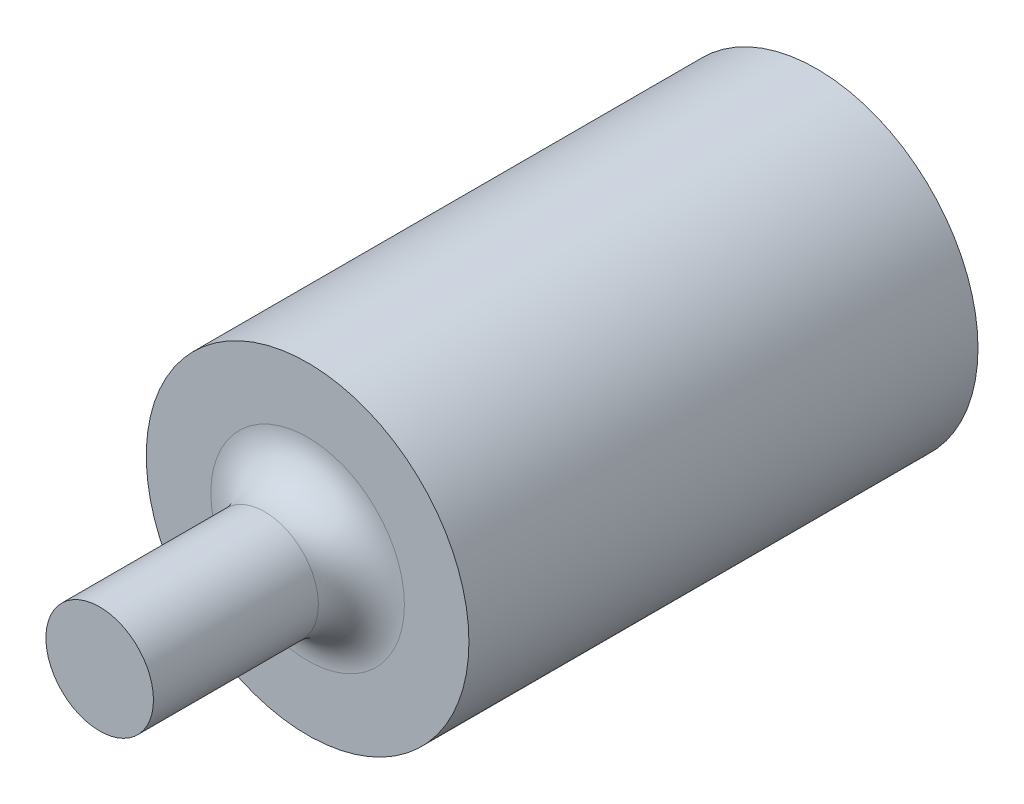
ISO-10303-21;
HEADER;
FILE_DESCRIPTION(('STEP AP214'),'2;1');
FILE_NAME('part.step','',(''),(''),'','','');
FILE_SCHEMA(('AUTOMOTIVE_DESIGN { 1 0 10303 214 1 1 1 1 }'));
ENDSEC;
DATA;
#1=APPLICATION_CONTEXT('core data for automotive mechanical design processes');
#2=APPLICATION_PROTOCOL_DEFINITION('international standard','automotive_design',2000,#1);
#3=PRODUCT_CONTEXT('',#1,'mechanical');
#4=PRODUCT('Part','Part','',(#3));
#5=PRODUCT_RELATED_PRODUCT_CATEGORY('part','',(#4));
#6=PRODUCT_DEFINITION_FORMATION('','',#4);
#7=PRODUCT_DEFINITION_CONTEXT('part definition',#1,'design');
#8=PRODUCT_DEFINITION('design','',#6,#7);
#9=PRODUCT_DEFINITION_SHAPE('','',#8);
#10=(LENGTH_UNIT() NAMED_UNIT(*) SI_UNIT(.MILLI.,.METRE.));
#11=(NAMED_UNIT(*) PLANE_ANGLE_UNIT() SI_UNIT($,.RADIAN.));
#12=(NAMED_UNIT(*) SI_UNIT($,.STERADIAN.) SOLID_ANGLE_UNIT());
#13=UNCERTAINTY_MEASURE_WITH_UNIT(LENGTH_MEASURE(1.E-05),#10,'distance_accuracy_value','');
#14=(GEOMETRIC_REPRESENTATION_CONTEXT(3) GLOBAL_UNCERTAINTY_ASSIGNED_CONTEXT((#13)) GLOBAL_UNIT_ASSIGNED_CONTEXT((#10,
#11,#12)) REPRESENTATION_CONTEXT('',''));
#15=CARTESIAN_POINT('',(0.,0.,0.));
#16=DIRECTION('',(0.,0.,1.));
#17=DIRECTION('',(1.,0.,0.));
#18=AXIS2_PLACEMENT_3D('',#15,#16,#17);
#19=CARTESIAN_POINT('',(0.,0.,35.5));
#20=DIRECTION('',(0.,0.,-1.));
#21=DIRECTION('',(-1.,0.,0.));
#22=AXIS2_PLACEMENT_3D('',#19,#20,#21);
#23=CYLINDRICAL_SURFACE('',#22,11.25);
#24=CARTESIAN_POINT('',(0.,0.,35.5));
#25=DIRECTION('',(0.,0.,1.));
#26=DIRECTION('',(1.,0.,0.));
#27=AXIS2_PLACEMENT_3D('',#24,#25,#26);
#28=CIRCLE('',#27,11.25);
#29=CARTESIAN_POINT('',(11.25,0.,35.5));
#30=VERTEX_POINT('',#29);
#31=EDGE_CURVE('E54',#30,#30,#28,.T.);
#32=ORIENTED_EDGE('',*,*,#31,.F.);
#33=EDGE_LOOP('',(#32));
#34=FACE_BOUND('',#33,.T.);
#35=CARTESIAN_POINT('',(0.,0.,0.));
#36=DIRECTION('',(0.,0.,1.));
#37=DIRECTION('',(1.,0.,0.));
#38=AXIS2_PLACEMENT_3D('',#35,#36,#37);
#39=CIRCLE('',#38,11.25);
#40=CARTESIAN_POINT('',(11.25,0.,0.));
#41=VERTEX_POINT('',#40);
#42=EDGE_CURVE('E58',#41,#41,#39,.T.);
#43=ORIENTED_EDGE('',*,*,#42,.T.);
#44=EDGE_LOOP('',(#43));
#45=FACE_BOUND('',#44,.T.);
#46=ADVANCED_FACE('F43',(#34,#45),#23,.T.);
#47=CARTESIAN_POINT('',(0.,0.,35.5));
#48=DIRECTION('',(0.,0.,1.));
#49=DIRECTION('',(1.,0.,0.));
#50=AXIS2_PLACEMENT_3D('',#47,#48,#49);
#51=PLANE('',#50);
#52=CARTESIAN_POINT('',(0.,0.,35.5));
#53=DIRECTION('',(0.,0.,1.));
#54=DIRECTION('',(1.,0.,0.));
#55=AXIS2_PLACEMENT_3D('',#52,#53,#54);
#56=CIRCLE('',#55,6.75);
#57=CARTESIAN_POINT('',(6.75,0.,35.5));
#58=VERTEX_POINT('',#57);
#59=EDGE_CURVE('E12',#58,#58,#56,.F.);
#60=ORIENTED_EDGE('',*,*,#59,.T.);
#61=EDGE_LOOP('',(#60));
#62=FACE_BOUND('',#61,.T.);
#63=ORIENTED_EDGE('',*,*,#31,.T.);
#64=EDGE_LOOP('',(#63));
#65=FACE_BOUND('',#64,.T.);
#66=ADVANCED_FACE('F104',(#62,#65),#51,.T.);
#67=CARTESIAN_POINT('',(0.,0.,0.));
#68=DIRECTION('',(0.,0.,1.));
#69=DIRECTION('',(1.,0.,0.));
#70=AXIS2_PLACEMENT_3D('',#67,#68,#69);
#71=PLANE('',#70);
#72=CARTESIAN_POINT('',(8.5,0.,0.));
#73=DIRECTION('',(0.,0.,-1.));
#74=DIRECTION('',(-1.,0.,0.));
#75=AXIS2_PLACEMENT_3D('',#72,#73,#74);
#76=CIRCLE('',#75,1.5);
#77=CARTESIAN_POINT('',(7.,0.,0.));
#78=VERTEX_POINT('',#77);
#79=EDGE_CURVE('E85',#78,#78,#76,.T.);
#80=ORIENTED_EDGE('',*,*,#79,.F.);
#81=EDGE_LOOP('',(#80));
#82=FACE_BOUND('',#81,.T.);
#83=CARTESIAN_POINT('',(-8.5,0.,0.));
#84=DIRECTION('',(0.,0.,-1.));
#85=DIRECTION('',(1.,0.,0.));
#86=AXIS2_PLACEMENT_3D('',#83,#84,#85);
#87=CIRCLE('',#86,1.5);
#88=CARTESIAN_POINT('',(-7.,0.,0.));
#89=VERTEX_POINT('',#88);
#90=EDGE_CURVE('E79',#89,#89,#87,.T.);
#91=ORIENTED_EDGE('',*,*,#90,.F.);
#92=EDGE_LOOP('',(#91));
#93=FACE_BOUND('',#92,.T.);
#94=CARTESIAN_POINT('',(0.,-8.5,0.));
#95=DIRECTION('',(0.,0.,-1.));
#96=DIRECTION('',(-1.,0.,0.));
#97=AXIS2_PLACEMENT_3D('',#94,#95,#96);
#98=CIRCLE('',#97,1.5);
#99=CARTESIAN_POINT('',(-1.50000000000009,-8.5,0.));
#100=VERTEX_POINT('',#99);
#101=EDGE_CURVE('E73',#100,#100,#98,.T.);
#102=ORIENTED_EDGE('',*,*,#101,.F.);
#103=EDGE_LOOP('',(#102));
#104=FACE_BOUND('',#103,.T.);
#105=CARTESIAN_POINT('',(0.,8.5,0.));
#106=DIRECTION('',(0.,0.,-1.));
#107=DIRECTION('',(1.,0.,0.));
#108=AXIS2_PLACEMENT_3D('',#105,#106,#107);
#109=CIRCLE('',#108,1.5);
#110=CARTESIAN_POINT('',(1.50000000000009,8.5,0.));
#111=VERTEX_POINT('',#110);
#112=EDGE_CURVE('E67',#111,#111,#109,.T.);
#113=ORIENTED_EDGE('',*,*,#112,.F.);
#114=EDGE_LOOP('',(#113));
#115=FACE_BOUND('',#114,.T.);
#116=ORIENTED_EDGE('',*,*,#42,.F.);
#117=EDGE_LOOP('',(#116));
#118=FACE_BOUND('',#117,.T.);
#119=ADVANCED_FACE('F100',(#82,#93,#104,#115,#118),#71,.F.);
#120=CARTESIAN_POINT('',(0.,0.,50.));
#121=DIRECTION('',(0.,0.,-1.));
#122=DIRECTION('',(-1.,0.,0.));
#123=AXIS2_PLACEMENT_3D('',#120,#121,#122);
#124=CYLINDRICAL_SURFACE('',#123,3.75);
#125=CARTESIAN_POINT('',(0.,0.,38.5));
#126=DIRECTION('',(0.,0.,1.));
#127=DIRECTION('',(1.,0.,0.));
#128=AXIS2_PLACEMENT_3D('',#125,#126,#127);
#129=CIRCLE('',#128,3.75);
#130=CARTESIAN_POINT('',(3.75,0.,38.5));
#131=VERTEX_POINT('',#130);
#132=EDGE_CURVE('E50',#131,#131,#129,.T.);
#133=ORIENTED_EDGE('',*,*,#132,.T.);
#134=EDGE_LOOP('',(#133));
#135=FACE_BOUND('',#134,.T.);
#136=CARTESIAN_POINT('',(0.,0.,50.));
#137=DIRECTION('',(0.,0.,1.));
#138=DIRECTION('',(1.,0.,0.));
#139=AXIS2_PLACEMENT_3D('',#136,#137,#138);
#140=CIRCLE('',#139,3.75);
#141=CARTESIAN_POINT('',(3.75,0.,50.));
#142=VERTEX_POINT('',#141);
#143=EDGE_CURVE('E62',#142,#142,#140,.T.);
#144=ORIENTED_EDGE('',*,*,#143,.F.);
#145=EDGE_LOOP('',(#144));
#146=FACE_BOUND('',#145,.T.);
#147=ADVANCED_FACE('F103',(#135,#146),#124,.T.);
#148=CARTESIAN_POINT('',(0.,0.,50.));
#149=DIRECTION('',(0.,0.,1.));
#150=DIRECTION('',(1.,0.,0.));
#151=AXIS2_PLACEMENT_3D('',#148,#149,#150);
#152=PLANE('',#151);
#153=ORIENTED_EDGE('',*,*,#143,.T.);
#154=EDGE_LOOP('',(#153));
#155=FACE_BOUND('',#154,.T.);
#156=ADVANCED_FACE('F124',(#155),#152,.T.);
#157=CARTESIAN_POINT('',(0.,0.,38.5));
#158=DIRECTION('',(0.,0.,1.));
#159=DIRECTION('',(1.,0.,0.));
#160=AXIS2_PLACEMENT_3D('',#157,#158,#159);
#161=TOROIDAL_SURFACE('',#160,6.75,3.);
#162=ORIENTED_EDGE('',*,*,#59,.F.);
#163=EDGE_LOOP('',(#162));
#164=FACE_BOUND('',#163,.T.);
#165=ORIENTED_EDGE('',*,*,#132,.F.);
#166=EDGE_LOOP('',(#165));
#167=FACE_BOUND('',#166,.T.);
#168=ADVANCED_FACE('F45',(#164,#167),#161,.F.);
#169=CARTESIAN_POINT('',(0.,8.5,10.));
#170=DIRECTION('',(0.,0.,-1.));
#171=DIRECTION('',(-1.,0.,0.));
#172=AXIS2_PLACEMENT_3D('',#169,#170,#171);
#173=CYLINDRICAL_SURFACE('',#172,1.5);
#174=CARTESIAN_POINT('',(0.,8.5,10.));
#175=DIRECTION('',(0.,0.,-1.));
#176=DIRECTION('',(1.,0.,0.));
#177=AXIS2_PLACEMENT_3D('',#174,#175,#176);
#178=CIRCLE('',#177,1.5);
#179=CARTESIAN_POINT('',(1.50000000000009,8.5,10.));
#180=VERTEX_POINT('',#179);
#181=EDGE_CURVE('E70',#180,#180,#178,.T.);
#182=ORIENTED_EDGE('',*,*,#181,.F.);
#183=EDGE_LOOP('',(#182));
#184=FACE_BOUND('',#183,.T.);
#185=ORIENTED_EDGE('',*,*,#112,.T.);
#186=EDGE_LOOP('',(#185));
#187=FACE_BOUND('',#186,.T.);
#188=ADVANCED_FACE('F128',(#184,#187),#173,.F.);
#189=CARTESIAN_POINT('',(0.,8.5,10.));
#190=DIRECTION('',(0.,0.,1.));
#191=DIRECTION('',(1.,0.,0.));
#192=AXIS2_PLACEMENT_3D('',#189,#190,#191);
#193=PLANE('',#192);
#194=ORIENTED_EDGE('',*,*,#181,.T.);
#195=EDGE_LOOP('',(#194));
#196=FACE_BOUND('',#195,.T.);
#197=ADVANCED_FACE('F131',(#196),#193,.F.);
#198=CARTESIAN_POINT('',(0.,-8.5,10.));
#199=DIRECTION('',(0.,0.,-1.));
#200=DIRECTION('',(-1.,0.,0.));
#201=AXIS2_PLACEMENT_3D('',#198,#199,#200);
#202=CYLINDRICAL_SURFACE('',#201,1.5);
#203=CARTESIAN_POINT('',(0.,-8.5,10.));
#204=DIRECTION('',(0.,0.,-1.));
#205=DIRECTION('',(-1.,0.,0.));
#206=AXIS2_PLACEMENT_3D('',#203,#204,#205);
#207=CIRCLE('',#206,1.5);
#208=CARTESIAN_POINT('',(-1.50000000000009,-8.5,10.));
#209=VERTEX_POINT('',#208);
#210=EDGE_CURVE('E76',#209,#209,#207,.T.);
#211=ORIENTED_EDGE('',*,*,#210,.F.);
#212=EDGE_LOOP('',(#211));
#213=FACE_BOUND('',#212,.T.);
#214=ORIENTED_EDGE('',*,*,#101,.T.);
#215=EDGE_LOOP('',(#214));
#216=FACE_BOUND('',#215,.T.);
#217=ADVANCED_FACE('F135',(#213,#216),#202,.F.);
#218=CARTESIAN_POINT('',(0.,-8.5,10.));
#219=DIRECTION('',(0.,0.,-1.));
#220=DIRECTION('',(-1.,0.,0.));
#221=AXIS2_PLACEMENT_3D('',#218,#219,#220);
#222=PLANE('',#221);
#223=ORIENTED_EDGE('',*,*,#210,.T.);
#224=EDGE_LOOP('',(#223));
#225=FACE_BOUND('',#224,.T.);
#226=ADVANCED_FACE('F139',(#225),#222,.T.);
#227=CARTESIAN_POINT('',(-8.5,0.,10.));
#228=DIRECTION('',(0.,0.,-1.));
#229=DIRECTION('',(-1.,0.,0.));
#230=AXIS2_PLACEMENT_3D('',#227,#228,#229);
#231=CYLINDRICAL_SURFACE('',#230,1.5);
#232=CARTESIAN_POINT('',(-8.5,0.,10.));
#233=DIRECTION('',(0.,0.,-1.));
#234=DIRECTION('',(1.,0.,0.));
#235=AXIS2_PLACEMENT_3D('',#232,#233,#234);
#236=CIRCLE('',#235,1.5);
#237=CARTESIAN_POINT('',(-7.,0.,10.));
#238=VERTEX_POINT('',#237);
#239=EDGE_CURVE('E82',#238,#238,#236,.T.);
#240=ORIENTED_EDGE('',*,*,#239,.F.);
#241=EDGE_LOOP('',(#240));
#242=FACE_BOUND('',#241,.T.);
#243=ORIENTED_EDGE('',*,*,#90,.T.);
#244=EDGE_LOOP('',(#243));
#245=FACE_BOUND('',#244,.T.);
#246=ADVANCED_FACE('F143',(#242,#245),#231,.F.);
#247=CARTESIAN_POINT('',(-8.5,0.,10.));
#248=DIRECTION('',(0.,0.,1.));
#249=DIRECTION('',(1.,0.,0.));
#250=AXIS2_PLACEMENT_3D('',#247,#248,#249);
#251=PLANE('',#250);
#252=ORIENTED_EDGE('',*,*,#239,.T.);
#253=EDGE_LOOP('',(#252));
#254=FACE_BOUND('',#253,.T.);
#255=ADVANCED_FACE('F96',(#254),#251,.F.);
#256=CARTESIAN_POINT('',(8.5,0.,10.));
#257=DIRECTION('',(0.,0.,-1.));
#258=DIRECTION('',(-1.,0.,0.));
#259=AXIS2_PLACEMENT_3D('',#256,#257,#258);
#260=CYLINDRICAL_SURFACE('',#259,1.5);
#261=CARTESIAN_POINT('',(8.5,0.,10.));
#262=DIRECTION('',(0.,0.,-1.));
#263=DIRECTION('',(-1.,0.,0.));
#264=AXIS2_PLACEMENT_3D('',#261,#262,#263);
#265=CIRCLE('',#264,1.5);
#266=CARTESIAN_POINT('',(7.,0.,10.));
#267=VERTEX_POINT('',#266);
#268=EDGE_CURVE('E66',#267,#267,#265,.T.);
#269=ORIENTED_EDGE('',*,*,#268,.F.);
#270=EDGE_LOOP('',(#269));
#271=FACE_BOUND('',#270,.T.);
#272=ORIENTED_EDGE('',*,*,#79,.T.);
#273=EDGE_LOOP('',(#272));
#274=FACE_BOUND('',#273,.T.);
#275=ADVANCED_FACE('F93',(#271,#274),#260,.F.);
#276=CARTESIAN_POINT('',(8.5,0.,10.));
#277=DIRECTION('',(0.,0.,-1.));
#278=DIRECTION('',(-1.,0.,0.));
#279=AXIS2_PLACEMENT_3D('',#276,#277,#278);
#280=PLANE('',#279);
#281=ORIENTED_EDGE('',*,*,#268,.T.);
#282=EDGE_LOOP('',(#281));
#283=FACE_BOUND('',#282,.T.);
#284=ADVANCED_FACE('F91',(#283),#280,.T.);
#285=CLOSED_SHELL('',(#46,#66,#119,#147,#156,#168,#188,#197,#217,#226,#246,#255,#275,#284));
#286=MANIFOLD_SOLID_BREP('B2',#285);
#287=ADVANCED_BREP_SHAPE_REPRESENTATION('',(#18,#286),#14);
#288=SHAPE_DEFINITION_REPRESENTATION(#9,#287);
ENDSEC;
END-ISO-10303-21;
